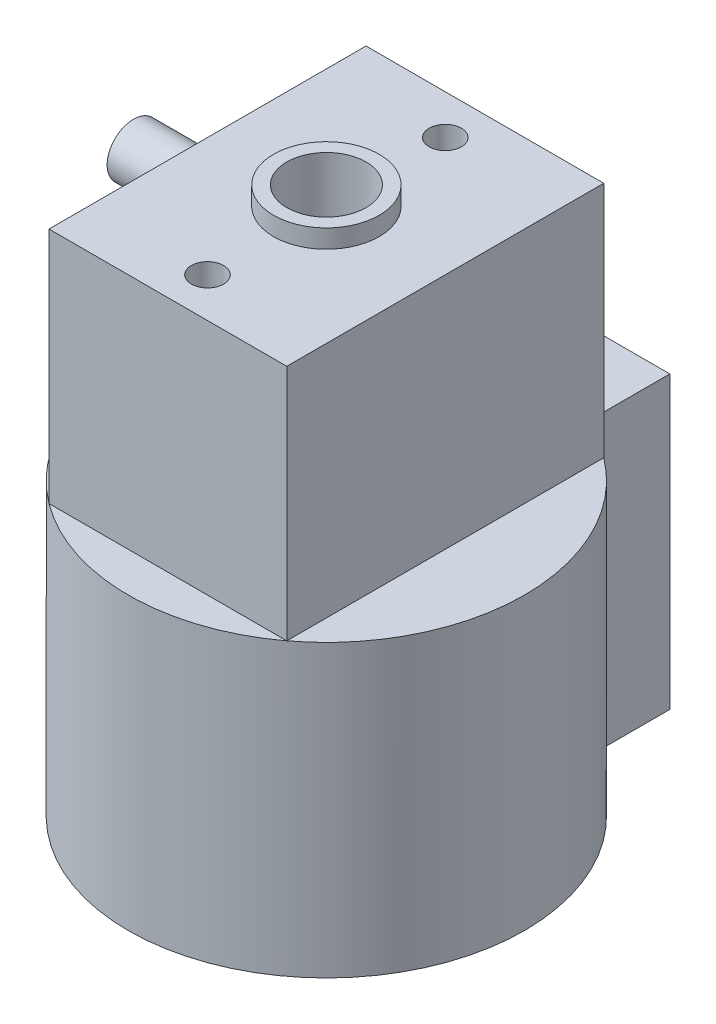
ISO-10303-21;
HEADER;
FILE_DESCRIPTION(('STEP AP214'),'2;1');
FILE_NAME('part.step','',(''),(''),'','','');
FILE_SCHEMA(('AUTOMOTIVE_DESIGN { 1 0 10303 214 1 1 1 1 }'));
ENDSEC;
DATA;
#1=APPLICATION_CONTEXT('core data for automotive mechanical design processes');
#2=APPLICATION_PROTOCOL_DEFINITION('international standard','automotive_design',2000,#1);
#3=PRODUCT_CONTEXT('',#1,'mechanical');
#4=PRODUCT('Part','Part','',(#3));
#5=PRODUCT_RELATED_PRODUCT_CATEGORY('part','',(#4));
#6=PRODUCT_DEFINITION_FORMATION('','',#4);
#7=PRODUCT_DEFINITION_CONTEXT('part definition',#1,'design');
#8=PRODUCT_DEFINITION('design','',#6,#7);
#9=PRODUCT_DEFINITION_SHAPE('','',#8);
#10=(LENGTH_UNIT() NAMED_UNIT(*) SI_UNIT(.MILLI.,.METRE.));
#11=(NAMED_UNIT(*) PLANE_ANGLE_UNIT() SI_UNIT($,.RADIAN.));
#12=(NAMED_UNIT(*) SI_UNIT($,.STERADIAN.) SOLID_ANGLE_UNIT());
#13=UNCERTAINTY_MEASURE_WITH_UNIT(LENGTH_MEASURE(1.E-05),#10,'distance_accuracy_value','');
#14=(GEOMETRIC_REPRESENTATION_CONTEXT(3) GLOBAL_UNCERTAINTY_ASSIGNED_CONTEXT((#13)) GLOBAL_UNIT_ASSIGNED_CONTEXT((#10,
#11,#12)) REPRESENTATION_CONTEXT('',''));
#15=CARTESIAN_POINT('',(0.,0.,0.));
#16=DIRECTION('',(0.,0.,1.));
#17=DIRECTION('',(1.,0.,0.));
#18=AXIS2_PLACEMENT_3D('',#15,#16,#17);
#19=CARTESIAN_POINT('',(0.,20.,0.));
#20=DIRECTION('',(0.,-1.,0.));
#21=DIRECTION('',(0.,0.,-1.));
#22=AXIS2_PLACEMENT_3D('',#19,#20,#21);
#23=CYLINDRICAL_SURFACE('',#22,7.5);
#24=CARTESIAN_POINT('',(0.,0.,0.));
#25=DIRECTION('',(0.,1.,0.));
#26=DIRECTION('',(0.,0.,1.));
#27=AXIS2_PLACEMENT_3D('',#24,#25,#26);
#28=CIRCLE('',#27,7.5);
#29=CARTESIAN_POINT('',(0.,0.,7.5));
#30=VERTEX_POINT('',#29);
#31=EDGE_CURVE('E143',#30,#30,#28,.T.);
#32=ORIENTED_EDGE('',*,*,#31,.T.);
#33=EDGE_LOOP('',(#32));
#34=FACE_BOUND('',#33,.T.);
#35=CARTESIAN_POINT('',(0.,11.,0.));
#36=DIRECTION('',(0.,1.,0.));
#37=DIRECTION('',(0.,0.,1.));
#38=AXIS2_PLACEMENT_3D('',#35,#36,#37);
#39=CIRCLE('',#38,7.5);
#40=CARTESIAN_POINT('',(4.5,11.,6.));
#41=VERTEX_POINT('',#40);
#42=CARTESIAN_POINT('',(4.5,11.,-6.));
#43=VERTEX_POINT('',#42);
#44=EDGE_CURVE('E59',#41,#43,#39,.T.);
#45=ORIENTED_EDGE('',*,*,#44,.F.);
#46=CARTESIAN_POINT('',(-4.5,11.,6.));
#47=VERTEX_POINT('',#46);
#48=EDGE_CURVE('E150',#47,#41,#39,.T.);
#49=ORIENTED_EDGE('',*,*,#48,.F.);
#50=CARTESIAN_POINT('',(-4.5,11.,-6.));
#51=VERTEX_POINT('',#50);
#52=EDGE_CURVE('E151',#51,#47,#39,.T.);
#53=ORIENTED_EDGE('',*,*,#52,.F.);
#54=EDGE_CURVE('E156',#43,#51,#39,.T.);
#55=ORIENTED_EDGE('',*,*,#54,.F.);
#56=EDGE_LOOP('',(#45,#49,#53,#55));
#57=FACE_BOUND('',#56,.T.);
#58=ADVANCED_FACE('F51',(#34,#57),#23,.T.);
#59=CARTESIAN_POINT('',(0.,20.,0.));
#60=DIRECTION('',(0.,-1.,0.));
#61=DIRECTION('',(0.,0.,-1.));
#62=AXIS2_PLACEMENT_3D('',#59,#60,#61);
#63=CYLINDRICAL_SURFACE('',#62,1.5);
#64=CARTESIAN_POINT('',(0.,-1.,0.));
#65=DIRECTION('',(0.,-1.,0.));
#66=DIRECTION('',(0.,0.,-1.));
#67=AXIS2_PLACEMENT_3D('',#64,#65,#66);
#68=CIRCLE('',#67,1.5);
#69=CARTESIAN_POINT('',(0.,-1.,-1.5));
#70=VERTEX_POINT('',#69);
#71=EDGE_CURVE('E235',#70,#70,#68,.T.);
#72=ORIENTED_EDGE('',*,*,#71,.T.);
#73=EDGE_LOOP('',(#72));
#74=FACE_BOUND('',#73,.T.);
#75=CARTESIAN_POINT('',(0.,20.7,0.));
#76=DIRECTION('',(0.,1.,0.));
#77=DIRECTION('',(0.,0.,1.));
#78=AXIS2_PLACEMENT_3D('',#75,#76,#77);
#79=CIRCLE('',#78,1.5);
#80=CARTESIAN_POINT('',(0.,20.7,1.5));
#81=VERTEX_POINT('',#80);
#82=EDGE_CURVE('E231',#81,#81,#79,.T.);
#83=ORIENTED_EDGE('',*,*,#82,.T.);
#84=EDGE_LOOP('',(#83));
#85=FACE_BOUND('',#84,.T.);
#86=ADVANCED_FACE('F53',(#74,#85),#63,.F.);
#87=CARTESIAN_POINT('',(0.,20.,0.));
#88=DIRECTION('',(0.,1.,0.));
#89=DIRECTION('',(0.,0.,1.));
#90=AXIS2_PLACEMENT_3D('',#87,#88,#89);
#91=PLANE('',#90);
#92=CARTESIAN_POINT('',(0.,20.,0.));
#93=DIRECTION('',(0.,1.,0.));
#94=DIRECTION('',(0.,0.,1.));
#95=AXIS2_PLACEMENT_3D('',#92,#93,#94);
#96=CIRCLE('',#95,2.);
#97=CARTESIAN_POINT('',(0.,20.,2.));
#98=VERTEX_POINT('',#97);
#99=EDGE_CURVE('E239',#98,#98,#96,.T.);
#100=ORIENTED_EDGE('',*,*,#99,.F.);
#101=EDGE_LOOP('',(#100));
#102=FACE_BOUND('',#101,.T.);
#103=CARTESIAN_POINT('',(0.,20.,4.5));
#104=DIRECTION('',(0.,1.,0.));
#105=DIRECTION('',(0.,0.,1.));
#106=AXIS2_PLACEMENT_3D('',#103,#104,#105);
#107=CIRCLE('',#106,0.6105);
#108=CARTESIAN_POINT('',(0.,20.,5.1105));
#109=VERTEX_POINT('',#108);
#110=EDGE_CURVE('E109',#109,#109,#107,.T.);
#111=ORIENTED_EDGE('',*,*,#110,.F.);
#112=EDGE_LOOP('',(#111));
#113=FACE_BOUND('',#112,.T.);
#114=CARTESIAN_POINT('',(0.,20.,-4.5));
#115=DIRECTION('',(0.,1.,0.));
#116=DIRECTION('',(0.,0.,1.));
#117=AXIS2_PLACEMENT_3D('',#114,#115,#116);
#118=CIRCLE('',#117,0.6105);
#119=CARTESIAN_POINT('',(0.,20.,-3.8895));
#120=VERTEX_POINT('',#119);
#121=EDGE_CURVE('E108',#120,#120,#118,.T.);
#122=ORIENTED_EDGE('',*,*,#121,.F.);
#123=EDGE_LOOP('',(#122));
#124=FACE_BOUND('',#123,.T.);
#125=DIRECTION('',(1.,0.,0.));
#126=VECTOR('',#125,1.);
#127=CARTESIAN_POINT('',(0.,20.,-6.));
#128=LINE('',#127,#126);
#129=CARTESIAN_POINT('',(-4.5,20.,-6.));
#130=VERTEX_POINT('',#129);
#131=CARTESIAN_POINT('',(4.5,20.,-6.));
#132=VERTEX_POINT('',#131);
#133=EDGE_CURVE('E74',#130,#132,#128,.T.);
#134=ORIENTED_EDGE('',*,*,#133,.F.);
#135=DIRECTION('',(0.,0.,-1.));
#136=VECTOR('',#135,1.);
#137=CARTESIAN_POINT('',(-4.5,20.,0.));
#138=LINE('',#137,#136);
#139=CARTESIAN_POINT('',(-4.5,20.,6.));
#140=VERTEX_POINT('',#139);
#141=EDGE_CURVE('E125',#140,#130,#138,.T.);
#142=ORIENTED_EDGE('',*,*,#141,.F.);
#143=DIRECTION('',(-1.,0.,0.));
#144=VECTOR('',#143,1.);
#145=CARTESIAN_POINT('',(0.,20.,6.));
#146=LINE('',#145,#144);
#147=CARTESIAN_POINT('',(4.5,20.,6.));
#148=VERTEX_POINT('',#147);
#149=EDGE_CURVE('E136',#148,#140,#146,.T.);
#150=ORIENTED_EDGE('',*,*,#149,.F.);
#151=DIRECTION('',(0.,0.,1.));
#152=VECTOR('',#151,1.);
#153=CARTESIAN_POINT('',(4.5,20.,0.));
#154=LINE('',#153,#152);
#155=EDGE_CURVE('E133',#132,#148,#154,.T.);
#156=ORIENTED_EDGE('',*,*,#155,.F.);
#157=EDGE_LOOP('',(#134,#142,#150,#156));
#158=FACE_BOUND('',#157,.T.);
#159=ADVANCED_FACE('F176',(#102,#113,#124,#158),#91,.T.);
#160=CARTESIAN_POINT('',(0.,0.,0.));
#161=DIRECTION('',(0.,1.,0.));
#162=DIRECTION('',(0.,0.,1.));
#163=AXIS2_PLACEMENT_3D('',#160,#161,#162);
#164=PLANE('',#163);
#165=CARTESIAN_POINT('',(0.,0.,0.));
#166=DIRECTION('',(0.,1.,0.));
#167=DIRECTION('',(0.,0.,1.));
#168=AXIS2_PLACEMENT_3D('',#165,#166,#167);
#169=CIRCLE('',#168,3.);
#170=CARTESIAN_POINT('',(0.,0.,3.));
#171=VERTEX_POINT('',#170);
#172=EDGE_CURVE('E12',#171,#171,#169,.F.);
#173=ORIENTED_EDGE('',*,*,#172,.F.);
#174=EDGE_LOOP('',(#173));
#175=FACE_BOUND('',#174,.T.);
#176=ORIENTED_EDGE('',*,*,#31,.F.);
#177=EDGE_LOOP('',(#176));
#178=FACE_BOUND('',#177,.T.);
#179=ADVANCED_FACE('F179',(#175,#178),#164,.F.);
#180=CARTESIAN_POINT('',(0.,11.,0.));
#181=DIRECTION('',(0.,1.,0.));
#182=DIRECTION('',(0.,0.,1.));
#183=AXIS2_PLACEMENT_3D('',#180,#181,#182);
#184=PLANE('',#183);
#185=ORIENTED_EDGE('',*,*,#44,.T.);
#186=DIRECTION('',(0.,0.,1.));
#187=VECTOR('',#186,1.);
#188=CARTESIAN_POINT('',(4.5,11.,0.));
#189=LINE('',#188,#187);
#190=EDGE_CURVE('E124',#43,#41,#189,.T.);
#191=ORIENTED_EDGE('',*,*,#190,.T.);
#192=EDGE_LOOP('',(#185,#191));
#193=FACE_BOUND('',#192,.T.);
#194=ADVANCED_FACE('F182',(#193),#184,.T.);
#195=ORIENTED_EDGE('',*,*,#54,.T.);
#196=DIRECTION('',(1.,0.,0.));
#197=VECTOR('',#196,1.);
#198=CARTESIAN_POINT('',(0.,11.,-6.));
#199=LINE('',#198,#197);
#200=EDGE_CURVE('E121',#51,#43,#199,.T.);
#201=ORIENTED_EDGE('',*,*,#200,.T.);
#202=EDGE_LOOP('',(#195,#201));
#203=FACE_BOUND('',#202,.T.);
#204=ADVANCED_FACE('F161',(#203),#184,.T.);
#205=ORIENTED_EDGE('',*,*,#52,.T.);
#206=DIRECTION('',(0.,0.,-1.));
#207=VECTOR('',#206,1.);
#208=CARTESIAN_POINT('',(-4.5,11.,0.));
#209=LINE('',#208,#207);
#210=EDGE_CURVE('E66',#47,#51,#209,.T.);
#211=ORIENTED_EDGE('',*,*,#210,.T.);
#212=EDGE_LOOP('',(#205,#211));
#213=FACE_BOUND('',#212,.T.);
#214=ADVANCED_FACE('F170',(#213),#184,.T.);
#215=ORIENTED_EDGE('',*,*,#48,.T.);
#216=DIRECTION('',(-1.,0.,0.));
#217=VECTOR('',#216,1.);
#218=CARTESIAN_POINT('',(0.,11.,6.));
#219=LINE('',#218,#217);
#220=EDGE_CURVE('E128',#41,#47,#219,.T.);
#221=ORIENTED_EDGE('',*,*,#220,.T.);
#222=EDGE_LOOP('',(#215,#221));
#223=FACE_BOUND('',#222,.T.);
#224=ADVANCED_FACE('F189',(#223),#184,.T.);
#225=CARTESIAN_POINT('',(0.,11.,-6.));
#226=DIRECTION('',(0.,0.,1.));
#227=DIRECTION('',(1.,0.,0.));
#228=AXIS2_PLACEMENT_3D('',#225,#226,#227);
#229=PLANE('',#228);
#230=ORIENTED_EDGE('',*,*,#133,.T.);
#231=DIRECTION('',(0.,1.,0.));
#232=VECTOR('',#231,1.);
#233=CARTESIAN_POINT('',(4.5,11.,-6.));
#234=LINE('',#233,#232);
#235=EDGE_CURVE('E131',#43,#132,#234,.T.);
#236=ORIENTED_EDGE('',*,*,#235,.F.);
#237=ORIENTED_EDGE('',*,*,#200,.F.);
#238=DIRECTION('',(0.,1.,0.));
#239=VECTOR('',#238,1.);
#240=CARTESIAN_POINT('',(-4.5,11.,-6.));
#241=LINE('',#240,#239);
#242=EDGE_CURVE('E141',#51,#130,#241,.T.);
#243=ORIENTED_EDGE('',*,*,#242,.T.);
#244=EDGE_LOOP('',(#230,#236,#237,#243));
#245=FACE_BOUND('',#244,.T.);
#246=ADVANCED_FACE('F167',(#245),#229,.F.);
#247=CARTESIAN_POINT('',(-4.5,11.,0.));
#248=DIRECTION('',(1.,0.,0.));
#249=DIRECTION('',(0.,0.,-1.));
#250=AXIS2_PLACEMENT_3D('',#247,#248,#249);
#251=PLANE('',#250);
#252=ORIENTED_EDGE('',*,*,#141,.T.);
#253=ORIENTED_EDGE('',*,*,#242,.F.);
#254=ORIENTED_EDGE('',*,*,#210,.F.);
#255=DIRECTION('',(0.,1.,0.));
#256=VECTOR('',#255,1.);
#257=CARTESIAN_POINT('',(-4.5,11.,6.));
#258=LINE('',#257,#256);
#259=EDGE_CURVE('E144',#47,#140,#258,.T.);
#260=ORIENTED_EDGE('',*,*,#259,.T.);
#261=EDGE_LOOP('',(#252,#253,#254,#260));
#262=FACE_BOUND('',#261,.T.);
#263=ADVANCED_FACE('F165',(#262),#251,.F.);
#264=CARTESIAN_POINT('',(0.,11.,6.));
#265=DIRECTION('',(0.,0.,-1.));
#266=DIRECTION('',(-1.,0.,0.));
#267=AXIS2_PLACEMENT_3D('',#264,#265,#266);
#268=PLANE('',#267);
#269=ORIENTED_EDGE('',*,*,#149,.T.);
#270=ORIENTED_EDGE('',*,*,#259,.F.);
#271=ORIENTED_EDGE('',*,*,#220,.F.);
#272=DIRECTION('',(0.,1.,0.));
#273=VECTOR('',#272,1.);
#274=CARTESIAN_POINT('',(4.5,11.,6.));
#275=LINE('',#274,#273);
#276=EDGE_CURVE('E146',#41,#148,#275,.T.);
#277=ORIENTED_EDGE('',*,*,#276,.T.);
#278=EDGE_LOOP('',(#269,#270,#271,#277));
#279=FACE_BOUND('',#278,.T.);
#280=ADVANCED_FACE('F194',(#279),#268,.F.);
#281=CARTESIAN_POINT('',(4.5,11.,0.));
#282=DIRECTION('',(-1.,0.,0.));
#283=DIRECTION('',(0.,0.,1.));
#284=AXIS2_PLACEMENT_3D('',#281,#282,#283);
#285=PLANE('',#284);
#286=ORIENTED_EDGE('',*,*,#155,.T.);
#287=ORIENTED_EDGE('',*,*,#276,.F.);
#288=ORIENTED_EDGE('',*,*,#190,.F.);
#289=ORIENTED_EDGE('',*,*,#235,.T.);
#290=EDGE_LOOP('',(#286,#287,#288,#289));
#291=FACE_BOUND('',#290,.T.);
#292=ADVANCED_FACE('F190',(#291),#285,.F.);
#293=CARTESIAN_POINT('',(0.,14.7,-4.5));
#294=DIRECTION('',(0.,1.,0.));
#295=DIRECTION('',(0.,0.,1.));
#296=AXIS2_PLACEMENT_3D('',#293,#294,#295);
#297=CONICAL_SURFACE('',#296,0.6105,1.02974425867665);
#298=CARTESIAN_POINT('',(0.,14.3331745920837,-4.5));
#299=VERTEX_POINT('',#298);
#300=VERTEX_LOOP('',#299);
#301=FACE_BOUND('',#300,.T.);
#302=CARTESIAN_POINT('',(0.,14.7,-4.5));
#303=DIRECTION('',(0.,1.,0.));
#304=DIRECTION('',(0.,0.,1.));
#305=AXIS2_PLACEMENT_3D('',#302,#303,#304);
#306=CIRCLE('',#305,0.6105);
#307=CARTESIAN_POINT('',(0.,14.7,-3.8895));
#308=VERTEX_POINT('',#307);
#309=EDGE_CURVE('E112',#308,#308,#306,.T.);
#310=ORIENTED_EDGE('',*,*,#309,.T.);
#311=EDGE_LOOP('',(#310));
#312=FACE_BOUND('',#311,.T.);
#313=ADVANCED_FACE('F193',(#301,#312),#297,.F.);
#314=CARTESIAN_POINT('',(0.,20.,-4.5));
#315=DIRECTION('',(0.,1.,0.));
#316=DIRECTION('',(0.,0.,1.));
#317=AXIS2_PLACEMENT_3D('',#314,#315,#316);
#318=CYLINDRICAL_SURFACE('',#317,0.6105);
#319=ORIENTED_EDGE('',*,*,#309,.F.);
#320=EDGE_LOOP('',(#319));
#321=FACE_BOUND('',#320,.T.);
#322=ORIENTED_EDGE('',*,*,#121,.T.);
#323=EDGE_LOOP('',(#322));
#324=FACE_BOUND('',#323,.T.);
#325=ADVANCED_FACE('F102',(#321,#324),#318,.F.);
#326=CARTESIAN_POINT('',(0.,14.7,4.5));
#327=DIRECTION('',(0.,1.,0.));
#328=DIRECTION('',(0.,0.,1.));
#329=AXIS2_PLACEMENT_3D('',#326,#327,#328);
#330=CONICAL_SURFACE('',#329,0.6105,1.02974425867665);
#331=CARTESIAN_POINT('',(0.,14.3331745920837,4.5));
#332=VERTEX_POINT('',#331);
#333=VERTEX_LOOP('',#332);
#334=FACE_BOUND('',#333,.T.);
#335=CARTESIAN_POINT('',(0.,14.7,4.5));
#336=DIRECTION('',(0.,1.,0.));
#337=DIRECTION('',(0.,0.,1.));
#338=AXIS2_PLACEMENT_3D('',#335,#336,#337);
#339=CIRCLE('',#338,0.6105);
#340=CARTESIAN_POINT('',(0.,14.7,5.1105));
#341=VERTEX_POINT('',#340);
#342=EDGE_CURVE('E106',#341,#341,#339,.T.);
#343=ORIENTED_EDGE('',*,*,#342,.T.);
#344=EDGE_LOOP('',(#343));
#345=FACE_BOUND('',#344,.T.);
#346=ADVANCED_FACE('F98',(#334,#345),#330,.F.);
#347=CARTESIAN_POINT('',(0.,20.,4.5));
#348=DIRECTION('',(0.,1.,0.));
#349=DIRECTION('',(0.,0.,1.));
#350=AXIS2_PLACEMENT_3D('',#347,#348,#349);
#351=CYLINDRICAL_SURFACE('',#350,0.6105);
#352=ORIENTED_EDGE('',*,*,#342,.F.);
#353=EDGE_LOOP('',(#352));
#354=FACE_BOUND('',#353,.T.);
#355=ORIENTED_EDGE('',*,*,#110,.T.);
#356=EDGE_LOOP('',(#355));
#357=FACE_BOUND('',#356,.T.);
#358=ADVANCED_FACE('F101',(#354,#357),#351,.F.);
#359=CARTESIAN_POINT('',(0.,-1.,0.));
#360=DIRECTION('',(0.,1.,0.));
#361=DIRECTION('',(0.,0.,1.));
#362=AXIS2_PLACEMENT_3D('',#359,#360,#361);
#363=CYLINDRICAL_SURFACE('',#362,3.);
#364=CARTESIAN_POINT('',(0.,-1.,0.));
#365=DIRECTION('',(0.,-1.,0.));
#366=DIRECTION('',(0.,0.,-1.));
#367=AXIS2_PLACEMENT_3D('',#364,#365,#366);
#368=CIRCLE('',#367,3.);
#369=CARTESIAN_POINT('',(0.,-1.,-3.));
#370=VERTEX_POINT('',#369);
#371=EDGE_CURVE('E115',#370,#370,#368,.T.);
#372=ORIENTED_EDGE('',*,*,#371,.F.);
#373=EDGE_LOOP('',(#372));
#374=FACE_BOUND('',#373,.T.);
#375=ORIENTED_EDGE('',*,*,#172,.T.);
#376=EDGE_LOOP('',(#375));
#377=FACE_BOUND('',#376,.T.);
#378=ADVANCED_FACE('F211',(#374,#377),#363,.T.);
#379=CARTESIAN_POINT('',(0.,-1.,0.));
#380=DIRECTION('',(0.,-1.,0.));
#381=DIRECTION('',(0.,0.,-1.));
#382=AXIS2_PLACEMENT_3D('',#379,#380,#381);
#383=PLANE('',#382);
#384=ORIENTED_EDGE('',*,*,#71,.F.);
#385=EDGE_LOOP('',(#384));
#386=FACE_BOUND('',#385,.T.);
#387=ORIENTED_EDGE('',*,*,#371,.T.);
#388=EDGE_LOOP('',(#387));
#389=FACE_BOUND('',#388,.T.);
#390=ADVANCED_FACE('F214',(#386,#389),#383,.T.);
#391=CARTESIAN_POINT('',(0.,20.7,0.));
#392=DIRECTION('',(0.,-1.,0.));
#393=DIRECTION('',(0.,0.,-1.));
#394=AXIS2_PLACEMENT_3D('',#391,#392,#393);
#395=CYLINDRICAL_SURFACE('',#394,2.);
#396=CARTESIAN_POINT('',(0.,20.7,0.));
#397=DIRECTION('',(0.,1.,0.));
#398=DIRECTION('',(0.,0.,1.));
#399=AXIS2_PLACEMENT_3D('',#396,#397,#398);
#400=CIRCLE('',#399,2.);
#401=CARTESIAN_POINT('',(0.,20.7,2.));
#402=VERTEX_POINT('',#401);
#403=EDGE_CURVE('E234',#402,#402,#400,.T.);
#404=ORIENTED_EDGE('',*,*,#403,.F.);
#405=EDGE_LOOP('',(#404));
#406=FACE_BOUND('',#405,.T.);
#407=ORIENTED_EDGE('',*,*,#99,.T.);
#408=EDGE_LOOP('',(#407));
#409=FACE_BOUND('',#408,.T.);
#410=ADVANCED_FACE('F218',(#406,#409),#395,.T.);
#411=CARTESIAN_POINT('',(0.,20.7,0.));
#412=DIRECTION('',(0.,1.,0.));
#413=DIRECTION('',(0.,0.,1.));
#414=AXIS2_PLACEMENT_3D('',#411,#412,#413);
#415=PLANE('',#414);
#416=ORIENTED_EDGE('',*,*,#82,.F.);
#417=EDGE_LOOP('',(#416));
#418=FACE_BOUND('',#417,.T.);
#419=ORIENTED_EDGE('',*,*,#403,.T.);
#420=EDGE_LOOP('',(#419));
#421=FACE_BOUND('',#420,.T.);
#422=ADVANCED_FACE('F222',(#418,#421),#415,.T.);
#423=CLOSED_SHELL('',(#58,#86,#159,#179,#194,#204,#214,#224,#246,#263,#280,#292,#313,#325,#346,
#358,#378,#390,#410,#422));
#424=MANIFOLD_SOLID_BREP('B2',#423);
#425=CARTESIAN_POINT('',(3.,20.,0.));
#426=DIRECTION('',(1.,0.,0.));
#427=DIRECTION('',(0.,0.,-1.));
#428=AXIS2_PLACEMENT_3D('',#425,#426,#427);
#429=PLANE('',#428);
#430=DIRECTION('',(0.,-1.,0.));
#431=VECTOR('',#430,1.);
#432=CARTESIAN_POINT('',(3.,20.,-10.));
#433=LINE('',#432,#431);
#434=CARTESIAN_POINT('',(3.,11.,-10.));
#435=VERTEX_POINT('',#434);
#436=CARTESIAN_POINT('',(3.,0.,-10.));
#437=VERTEX_POINT('',#436);
#438=EDGE_CURVE('E414',#435,#437,#433,.T.);
#439=ORIENTED_EDGE('',*,*,#438,.F.);
#440=DIRECTION('',(0.,0.,1.));
#441=VECTOR('',#440,1.);
#442=CARTESIAN_POINT('',(3.,11.,0.));
#443=LINE('',#442,#441);
#444=CARTESIAN_POINT('',(3.,11.,-7.5));
#445=VERTEX_POINT('',#444);
#446=EDGE_CURVE('E446',#435,#445,#443,.T.);
#447=ORIENTED_EDGE('',*,*,#446,.T.);
#448=DIRECTION('',(0.,-1.,0.));
#449=VECTOR('',#448,1.);
#450=CARTESIAN_POINT('',(3.,20.,-7.5));
#451=LINE('',#450,#449);
#452=CARTESIAN_POINT('',(3.,0.,-7.5));
#453=VERTEX_POINT('',#452);
#454=EDGE_CURVE('E428',#445,#453,#451,.T.);
#455=ORIENTED_EDGE('',*,*,#454,.T.);
#456=DIRECTION('',(0.,0.,1.));
#457=VECTOR('',#456,1.);
#458=CARTESIAN_POINT('',(3.,0.,0.));
#459=LINE('',#458,#457);
#460=EDGE_CURVE('E451',#437,#453,#459,.T.);
#461=ORIENTED_EDGE('',*,*,#460,.F.);
#462=EDGE_LOOP('',(#439,#447,#455,#461));
#463=FACE_BOUND('',#462,.T.);
#464=ADVANCED_FACE('F407',(#463),#429,.T.);
#465=CARTESIAN_POINT('',(0.,20.,-10.));
#466=DIRECTION('',(0.,0.,-1.));
#467=DIRECTION('',(-1.,0.,0.));
#468=AXIS2_PLACEMENT_3D('',#465,#466,#467);
#469=PLANE('',#468);
#470=DIRECTION('',(0.,-1.,0.));
#471=VECTOR('',#470,1.);
#472=CARTESIAN_POINT('',(-7.,20.,-10.));
#473=LINE('',#472,#471);
#474=CARTESIAN_POINT('',(-7.,11.,-10.));
#475=VERTEX_POINT('',#474);
#476=CARTESIAN_POINT('',(-7.,0.,-10.));
#477=VERTEX_POINT('',#476);
#478=EDGE_CURVE('E460',#475,#477,#473,.T.);
#479=ORIENTED_EDGE('',*,*,#478,.F.);
#480=DIRECTION('',(1.,0.,0.));
#481=VECTOR('',#480,1.);
#482=CARTESIAN_POINT('',(0.,11.,-10.));
#483=LINE('',#482,#481);
#484=EDGE_CURVE('E452',#475,#435,#483,.T.);
#485=ORIENTED_EDGE('',*,*,#484,.T.);
#486=ORIENTED_EDGE('',*,*,#438,.T.);
#487=DIRECTION('',(1.,0.,0.));
#488=VECTOR('',#487,1.);
#489=CARTESIAN_POINT('',(0.,0.,-10.));
#490=LINE('',#489,#488);
#491=EDGE_CURVE('E471',#477,#437,#490,.T.);
#492=ORIENTED_EDGE('',*,*,#491,.F.);
#493=EDGE_LOOP('',(#479,#485,#486,#492));
#494=FACE_BOUND('',#493,.T.);
#495=ADVANCED_FACE('F469',(#494),#469,.T.);
#496=CARTESIAN_POINT('',(-7.,20.,0.));
#497=DIRECTION('',(-1.,0.,0.));
#498=DIRECTION('',(0.,0.,1.));
#499=AXIS2_PLACEMENT_3D('',#496,#497,#498);
#500=PLANE('',#499);
#501=CARTESIAN_POINT('',(-7.,2.,-8.7));
#502=DIRECTION('',(-1.,0.,0.));
#503=DIRECTION('',(0.,0.,1.));
#504=AXIS2_PLACEMENT_3D('',#501,#502,#503);
#505=CIRCLE('',#504,1.);
#506=CARTESIAN_POINT('',(-7.,2.,-7.7));
#507=VERTEX_POINT('',#506);
#508=EDGE_CURVE('E500',#507,#507,#505,.T.);
#509=ORIENTED_EDGE('',*,*,#508,.F.);
#510=EDGE_LOOP('',(#509));
#511=FACE_BOUND('',#510,.T.);
#512=CARTESIAN_POINT('',(-7.,4.5,-8.7));
#513=DIRECTION('',(-1.,0.,0.));
#514=DIRECTION('',(0.,0.,1.));
#515=AXIS2_PLACEMENT_3D('',#512,#513,#514);
#516=CIRCLE('',#515,1.);
#517=CARTESIAN_POINT('',(-7.,4.5,-7.7));
#518=VERTEX_POINT('',#517);
#519=EDGE_CURVE('E494',#518,#518,#516,.T.);
#520=ORIENTED_EDGE('',*,*,#519,.F.);
#521=EDGE_LOOP('',(#520));
#522=FACE_BOUND('',#521,.T.);
#523=CARTESIAN_POINT('',(-7.,7.,-8.7));
#524=DIRECTION('',(-1.,0.,0.));
#525=DIRECTION('',(0.,0.,1.));
#526=AXIS2_PLACEMENT_3D('',#523,#524,#525);
#527=CIRCLE('',#526,1.);
#528=CARTESIAN_POINT('',(-7.,7.,-7.7));
#529=VERTEX_POINT('',#528);
#530=EDGE_CURVE('E488',#529,#529,#527,.T.);
#531=ORIENTED_EDGE('',*,*,#530,.F.);
#532=EDGE_LOOP('',(#531));
#533=FACE_BOUND('',#532,.T.);
#534=CARTESIAN_POINT('',(-7.,9.5,-8.7));
#535=DIRECTION('',(-1.,0.,0.));
#536=DIRECTION('',(0.,0.,1.));
#537=AXIS2_PLACEMENT_3D('',#534,#535,#536);
#538=CIRCLE('',#537,1.);
#539=CARTESIAN_POINT('',(-7.,9.5,-7.7));
#540=VERTEX_POINT('',#539);
#541=EDGE_CURVE('E482',#540,#540,#538,.T.);
#542=ORIENTED_EDGE('',*,*,#541,.F.);
#543=EDGE_LOOP('',(#542));
#544=FACE_BOUND('',#543,.T.);
#545=DIRECTION('',(0.,-1.,0.));
#546=VECTOR('',#545,1.);
#547=CARTESIAN_POINT('',(-7.,20.,-7.5));
#548=LINE('',#547,#546);
#549=CARTESIAN_POINT('',(-7.,11.,-7.5));
#550=VERTEX_POINT('',#549);
#551=CARTESIAN_POINT('',(-7.,0.,-7.5));
#552=VERTEX_POINT('',#551);
#553=EDGE_CURVE('E458',#550,#552,#548,.T.);
#554=ORIENTED_EDGE('',*,*,#553,.F.);
#555=DIRECTION('',(0.,0.,-1.));
#556=VECTOR('',#555,1.);
#557=CARTESIAN_POINT('',(-7.,11.,0.));
#558=LINE('',#557,#556);
#559=EDGE_CURVE('E421',#550,#475,#558,.T.);
#560=ORIENTED_EDGE('',*,*,#559,.T.);
#561=ORIENTED_EDGE('',*,*,#478,.T.);
#562=DIRECTION('',(0.,0.,-1.));
#563=VECTOR('',#562,1.);
#564=CARTESIAN_POINT('',(-7.,0.,0.));
#565=LINE('',#564,#563);
#566=EDGE_CURVE('E462',#552,#477,#565,.T.);
#567=ORIENTED_EDGE('',*,*,#566,.F.);
#568=EDGE_LOOP('',(#554,#560,#561,#567));
#569=FACE_BOUND('',#568,.T.);
#570=ADVANCED_FACE('F515',(#511,#522,#533,#544,#569),#500,.T.);
#571=CARTESIAN_POINT('',(0.,20.,-7.5));
#572=DIRECTION('',(0.,0.,1.));
#573=DIRECTION('',(1.,0.,0.));
#574=AXIS2_PLACEMENT_3D('',#571,#572,#573);
#575=PLANE('',#574);
#576=ORIENTED_EDGE('',*,*,#454,.F.);
#577=DIRECTION('',(-1.,0.,0.));
#578=VECTOR('',#577,1.);
#579=CARTESIAN_POINT('',(0.,11.,-7.5));
#580=LINE('',#579,#578);
#581=EDGE_CURVE('E49',#445,#550,#580,.T.);
#582=ORIENTED_EDGE('',*,*,#581,.T.);
#583=ORIENTED_EDGE('',*,*,#553,.T.);
#584=DIRECTION('',(-1.,0.,0.));
#585=VECTOR('',#584,1.);
#586=CARTESIAN_POINT('',(0.,0.,-7.5));
#587=LINE('',#586,#585);
#588=EDGE_CURVE('E457',#453,#552,#587,.T.);
#589=ORIENTED_EDGE('',*,*,#588,.F.);
#590=EDGE_LOOP('',(#576,#582,#583,#589));
#591=FACE_BOUND('',#590,.T.);
#592=ADVANCED_FACE('F455',(#591),#575,.T.);
#593=CARTESIAN_POINT('',(0.,0.,0.));
#594=DIRECTION('',(0.,1.,0.));
#595=DIRECTION('',(0.,0.,1.));
#596=AXIS2_PLACEMENT_3D('',#593,#594,#595);
#597=PLANE('',#596);
#598=ORIENTED_EDGE('',*,*,#460,.T.);
#599=ORIENTED_EDGE('',*,*,#588,.T.);
#600=ORIENTED_EDGE('',*,*,#566,.T.);
#601=ORIENTED_EDGE('',*,*,#491,.T.);
#602=EDGE_LOOP('',(#598,#599,#600,#601));
#603=FACE_BOUND('',#602,.T.);
#604=ADVANCED_FACE('F475',(#603),#597,.F.);
#605=CARTESIAN_POINT('',(0.,11.,0.));
#606=DIRECTION('',(0.,1.,0.));
#607=DIRECTION('',(0.,0.,1.));
#608=AXIS2_PLACEMENT_3D('',#605,#606,#607);
#609=PLANE('',#608);
#610=ORIENTED_EDGE('',*,*,#484,.F.);
#611=ORIENTED_EDGE('',*,*,#559,.F.);
#612=ORIENTED_EDGE('',*,*,#581,.F.);
#613=ORIENTED_EDGE('',*,*,#446,.F.);
#614=EDGE_LOOP('',(#610,#611,#612,#613));
#615=FACE_BOUND('',#614,.T.);
#616=ADVANCED_FACE('F445',(#615),#609,.T.);
#617=CARTESIAN_POINT('',(-16.,9.5,-8.69999999999999));
#618=DIRECTION('',(1.,0.,0.));
#619=DIRECTION('',(0.,0.,-1.));
#620=AXIS2_PLACEMENT_3D('',#617,#618,#619);
#621=CYLINDRICAL_SURFACE('',#620,1.);
#622=CARTESIAN_POINT('',(-16.,9.5,-8.69999999999999));
#623=DIRECTION('',(-1.,0.,0.));
#624=DIRECTION('',(0.,0.,1.));
#625=AXIS2_PLACEMENT_3D('',#622,#623,#624);
#626=CIRCLE('',#625,1.);
#627=CARTESIAN_POINT('',(-16.,9.5,-7.69999999999999));
#628=VERTEX_POINT('',#627);
#629=EDGE_CURVE('E481',#628,#628,#626,.T.);
#630=ORIENTED_EDGE('',*,*,#629,.F.);
#631=EDGE_LOOP('',(#630));
#632=FACE_BOUND('',#631,.T.);
#633=ORIENTED_EDGE('',*,*,#541,.T.);
#634=EDGE_LOOP('',(#633));
#635=FACE_BOUND('',#634,.T.);
#636=ADVANCED_FACE('F526',(#632,#635),#621,.T.);
#637=CARTESIAN_POINT('',(-16.,9.5,-8.69999999999999));
#638=DIRECTION('',(-1.,0.,0.));
#639=DIRECTION('',(0.,0.,1.));
#640=AXIS2_PLACEMENT_3D('',#637,#638,#639);
#641=PLANE('',#640);
#642=ORIENTED_EDGE('',*,*,#629,.T.);
#643=EDGE_LOOP('',(#642));
#644=FACE_BOUND('',#643,.T.);
#645=ADVANCED_FACE('F528',(#644),#641,.T.);
#646=CARTESIAN_POINT('',(-16.,7.,-8.69999999999999));
#647=DIRECTION('',(1.,0.,0.));
#648=DIRECTION('',(0.,0.,-1.));
#649=AXIS2_PLACEMENT_3D('',#646,#647,#648);
#650=CYLINDRICAL_SURFACE('',#649,1.);
#651=CARTESIAN_POINT('',(-16.,7.,-8.69999999999999));
#652=DIRECTION('',(-1.,0.,0.));
#653=DIRECTION('',(0.,0.,1.));
#654=AXIS2_PLACEMENT_3D('',#651,#652,#653);
#655=CIRCLE('',#654,1.);
#656=CARTESIAN_POINT('',(-16.,7.,-7.69999999999999));
#657=VERTEX_POINT('',#656);
#658=EDGE_CURVE('E485',#657,#657,#655,.T.);
#659=ORIENTED_EDGE('',*,*,#658,.F.);
#660=EDGE_LOOP('',(#659));
#661=FACE_BOUND('',#660,.T.);
#662=ORIENTED_EDGE('',*,*,#530,.T.);
#663=EDGE_LOOP('',(#662));
#664=FACE_BOUND('',#663,.T.);
#665=ADVANCED_FACE('F535',(#661,#664),#650,.T.);
#666=CARTESIAN_POINT('',(-16.,7.,-8.69999999999999));
#667=DIRECTION('',(-1.,0.,0.));
#668=DIRECTION('',(0.,0.,1.));
#669=AXIS2_PLACEMENT_3D('',#666,#667,#668);
#670=PLANE('',#669);
#671=ORIENTED_EDGE('',*,*,#658,.T.);
#672=EDGE_LOOP('',(#671));
#673=FACE_BOUND('',#672,.T.);
#674=ADVANCED_FACE('F586',(#673),#670,.T.);
#675=CARTESIAN_POINT('',(-16.,4.5,-8.69999999999999));
#676=DIRECTION('',(1.,0.,0.));
#677=DIRECTION('',(0.,0.,-1.));
#678=AXIS2_PLACEMENT_3D('',#675,#676,#677);
#679=CYLINDRICAL_SURFACE('',#678,1.);
#680=CARTESIAN_POINT('',(-16.,4.5,-8.69999999999999));
#681=DIRECTION('',(-1.,0.,0.));
#682=DIRECTION('',(0.,0.,1.));
#683=AXIS2_PLACEMENT_3D('',#680,#681,#682);
#684=CIRCLE('',#683,1.);
#685=CARTESIAN_POINT('',(-16.,4.5,-7.69999999999999));
#686=VERTEX_POINT('',#685);
#687=EDGE_CURVE('E491',#686,#686,#684,.T.);
#688=ORIENTED_EDGE('',*,*,#687,.F.);
#689=EDGE_LOOP('',(#688));
#690=FACE_BOUND('',#689,.T.);
#691=ORIENTED_EDGE('',*,*,#519,.T.);
#692=EDGE_LOOP('',(#691));
#693=FACE_BOUND('',#692,.T.);
#694=ADVANCED_FACE('F596',(#690,#693),#679,.T.);
#695=CARTESIAN_POINT('',(-16.,4.5,-8.69999999999999));
#696=DIRECTION('',(-1.,0.,0.));
#697=DIRECTION('',(0.,0.,1.));
#698=AXIS2_PLACEMENT_3D('',#695,#696,#697);
#699=PLANE('',#698);
#700=ORIENTED_EDGE('',*,*,#687,.T.);
#701=EDGE_LOOP('',(#700));
#702=FACE_BOUND('',#701,.T.);
#703=ADVANCED_FACE('F511',(#702),#699,.T.);
#704=CARTESIAN_POINT('',(-16.,2.,-8.69999999999999));
#705=DIRECTION('',(1.,0.,0.));
#706=DIRECTION('',(0.,0.,-1.));
#707=AXIS2_PLACEMENT_3D('',#704,#705,#706);
#708=CYLINDRICAL_SURFACE('',#707,1.);
#709=CARTESIAN_POINT('',(-16.,2.,-8.69999999999999));
#710=DIRECTION('',(-1.,0.,0.));
#711=DIRECTION('',(0.,0.,1.));
#712=AXIS2_PLACEMENT_3D('',#709,#710,#711);
#713=CIRCLE('',#712,1.);
#714=CARTESIAN_POINT('',(-16.,2.,-7.69999999999999));
#715=VERTEX_POINT('',#714);
#716=EDGE_CURVE('E497',#715,#715,#713,.T.);
#717=ORIENTED_EDGE('',*,*,#716,.F.);
#718=EDGE_LOOP('',(#717));
#719=FACE_BOUND('',#718,.T.);
#720=ORIENTED_EDGE('',*,*,#508,.T.);
#721=EDGE_LOOP('',(#720));
#722=FACE_BOUND('',#721,.T.);
#723=ADVANCED_FACE('F508',(#719,#722),#708,.T.);
#724=CARTESIAN_POINT('',(-16.,2.,-8.69999999999999));
#725=DIRECTION('',(-1.,0.,0.));
#726=DIRECTION('',(0.,0.,1.));
#727=AXIS2_PLACEMENT_3D('',#724,#725,#726);
#728=PLANE('',#727);
#729=ORIENTED_EDGE('',*,*,#716,.T.);
#730=EDGE_LOOP('',(#729));
#731=FACE_BOUND('',#730,.T.);
#732=ADVANCED_FACE('F506',(#731),#728,.T.);
#733=CLOSED_SHELL('',(#464,#495,#570,#592,#604,#616,#636,#645,#665,#674,#694,#703,#723,#732));
#734=MANIFOLD_SOLID_BREP('B6',#733);
#735=ADVANCED_BREP_SHAPE_REPRESENTATION('',(#18,#424,#734),#14);
#736=SHAPE_DEFINITION_REPRESENTATION(#9,#735);
ENDSEC;
END-ISO-10303-21;
